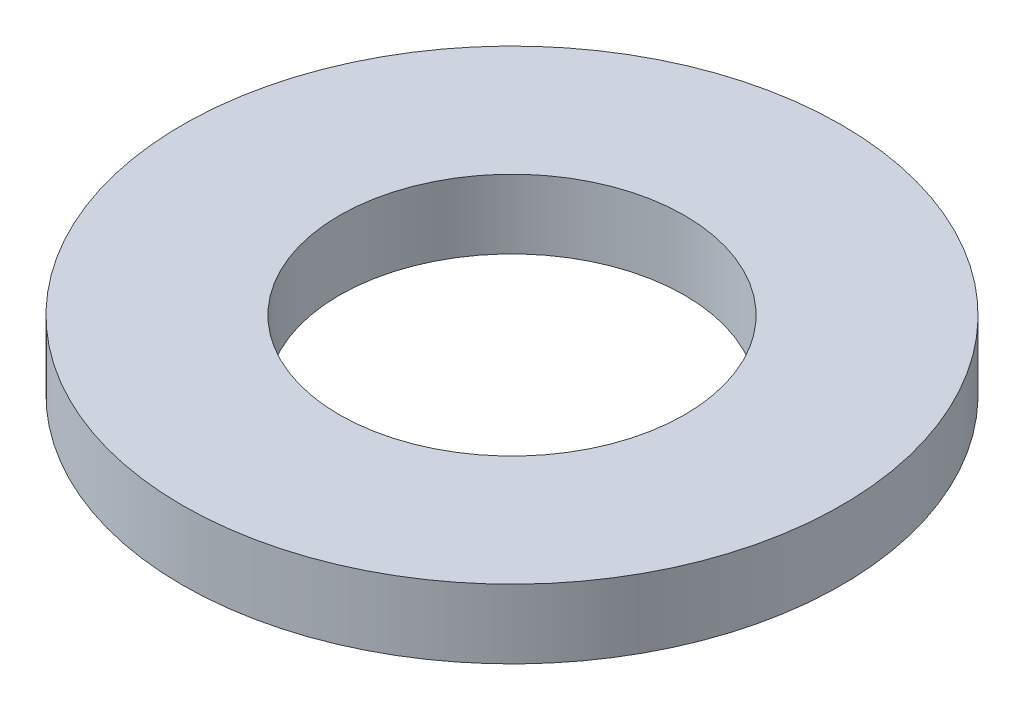
ISO-10303-21;
HEADER;
FILE_DESCRIPTION(('STEP AP214'),'2;1');
FILE_NAME('part.step','',(''),(''),'','','');
FILE_SCHEMA(('AUTOMOTIVE_DESIGN { 1 0 10303 214 1 1 1 1 }'));
ENDSEC;
DATA;
#1=APPLICATION_CONTEXT('core data for automotive mechanical design processes');
#2=APPLICATION_PROTOCOL_DEFINITION('international standard','automotive_design',2000,#1);
#3=PRODUCT_CONTEXT('',#1,'mechanical');
#4=PRODUCT('Part','Part','',(#3));
#5=PRODUCT_RELATED_PRODUCT_CATEGORY('part','',(#4));
#6=PRODUCT_DEFINITION_FORMATION('','',#4);
#7=PRODUCT_DEFINITION_CONTEXT('part definition',#1,'design');
#8=PRODUCT_DEFINITION('design','',#6,#7);
#9=PRODUCT_DEFINITION_SHAPE('','',#8);
#10=(LENGTH_UNIT() NAMED_UNIT(*) SI_UNIT(.MILLI.,.METRE.));
#11=(NAMED_UNIT(*) PLANE_ANGLE_UNIT() SI_UNIT($,.RADIAN.));
#12=(NAMED_UNIT(*) SI_UNIT($,.STERADIAN.) SOLID_ANGLE_UNIT());
#13=UNCERTAINTY_MEASURE_WITH_UNIT(LENGTH_MEASURE(1.E-05),#10,'distance_accuracy_value','');
#14=(GEOMETRIC_REPRESENTATION_CONTEXT(3) GLOBAL_UNCERTAINTY_ASSIGNED_CONTEXT((#13)) GLOBAL_UNIT_ASSIGNED_CONTEXT((#10,
#11,#12)) REPRESENTATION_CONTEXT('',''));
#15=CARTESIAN_POINT('',(0.,0.,0.));
#16=DIRECTION('',(0.,0.,1.));
#17=DIRECTION('',(1.,0.,0.));
#18=AXIS2_PLACEMENT_3D('',#15,#16,#17);
#19=CARTESIAN_POINT('',(0.,11.,0.));
#20=DIRECTION('',(0.,-1.,0.));
#21=DIRECTION('',(0.,0.,-1.));
#22=AXIS2_PLACEMENT_3D('',#19,#20,#21);
#23=CYLINDRICAL_SURFACE('',#22,52.5);
#24=CARTESIAN_POINT('',(0.,11.,0.));
#25=DIRECTION('',(0.,1.,0.));
#26=DIRECTION('',(0.,0.,1.));
#27=AXIS2_PLACEMENT_3D('',#24,#25,#26);
#28=CIRCLE('',#27,52.5);
#29=CARTESIAN_POINT('',(0.,11.,52.5));
#30=VERTEX_POINT('',#29);
#31=EDGE_CURVE('E10',#30,#30,#28,.T.);
#32=ORIENTED_EDGE('',*,*,#31,.F.);
#33=EDGE_LOOP('',(#32));
#34=FACE_BOUND('',#33,.T.);
#35=CARTESIAN_POINT('',(0.,0.,0.));
#36=DIRECTION('',(0.,1.,0.));
#37=DIRECTION('',(0.,0.,1.));
#38=AXIS2_PLACEMENT_3D('',#35,#36,#37);
#39=CIRCLE('',#38,52.5);
#40=CARTESIAN_POINT('',(0.,0.,52.5));
#41=VERTEX_POINT('',#40);
#42=EDGE_CURVE('E37',#41,#41,#39,.T.);
#43=ORIENTED_EDGE('',*,*,#42,.T.);
#44=EDGE_LOOP('',(#43));
#45=FACE_BOUND('',#44,.T.);
#46=ADVANCED_FACE('F40',(#34,#45),#23,.T.);
#47=CARTESIAN_POINT('',(0.,11.,0.));
#48=DIRECTION('',(0.,1.,0.));
#49=DIRECTION('',(0.,0.,1.));
#50=AXIS2_PLACEMENT_3D('',#47,#48,#49);
#51=PLANE('',#50);
#52=CARTESIAN_POINT('',(0.,11.,0.));
#53=DIRECTION('',(0.,1.,0.));
#54=DIRECTION('',(0.,0.,1.));
#55=AXIS2_PLACEMENT_3D('',#52,#53,#54);
#56=CIRCLE('',#55,27.5);
#57=CARTESIAN_POINT('',(0.,11.,27.5));
#58=VERTEX_POINT('',#57);
#59=EDGE_CURVE('E50',#58,#58,#56,.T.);
#60=ORIENTED_EDGE('',*,*,#59,.F.);
#61=EDGE_LOOP('',(#60));
#62=FACE_BOUND('',#61,.T.);
#63=ORIENTED_EDGE('',*,*,#31,.T.);
#64=EDGE_LOOP('',(#63));
#65=FACE_BOUND('',#64,.T.);
#66=ADVANCED_FACE('F59',(#62,#65),#51,.T.);
#67=CARTESIAN_POINT('',(0.,0.,0.));
#68=DIRECTION('',(0.,1.,0.));
#69=DIRECTION('',(0.,0.,1.));
#70=AXIS2_PLACEMENT_3D('',#67,#68,#69);
#71=PLANE('',#70);
#72=CARTESIAN_POINT('',(0.,0.,0.));
#73=DIRECTION('',(0.,1.,0.));
#74=DIRECTION('',(0.,0.,1.));
#75=AXIS2_PLACEMENT_3D('',#72,#73,#74);
#76=CIRCLE('',#75,27.5);
#77=CARTESIAN_POINT('',(0.,0.,27.5));
#78=VERTEX_POINT('',#77);
#79=EDGE_CURVE('E47',#78,#78,#76,.T.);
#80=ORIENTED_EDGE('',*,*,#79,.T.);
#81=EDGE_LOOP('',(#80));
#82=FACE_BOUND('',#81,.T.);
#83=ORIENTED_EDGE('',*,*,#42,.F.);
#84=EDGE_LOOP('',(#83));
#85=FACE_BOUND('',#84,.T.);
#86=ADVANCED_FACE('F58',(#82,#85),#71,.F.);
#87=CARTESIAN_POINT('',(0.,11.,0.));
#88=DIRECTION('',(0.,-1.,0.));
#89=DIRECTION('',(0.,0.,-1.));
#90=AXIS2_PLACEMENT_3D('',#87,#88,#89);
#91=CYLINDRICAL_SURFACE('',#90,27.5);
#92=ORIENTED_EDGE('',*,*,#59,.T.);
#93=EDGE_LOOP('',(#92));
#94=FACE_BOUND('',#93,.T.);
#95=ORIENTED_EDGE('',*,*,#79,.F.);
#96=EDGE_LOOP('',(#95));
#97=FACE_BOUND('',#96,.T.);
#98=ADVANCED_FACE('F54',(#94,#97),#91,.F.);
#99=CLOSED_SHELL('',(#46,#66,#86,#98));
#100=MANIFOLD_SOLID_BREP('B2',#99);
#101=ADVANCED_BREP_SHAPE_REPRESENTATION('',(#18,#100),#14);
#102=SHAPE_DEFINITION_REPRESENTATION(#9,#101);
ENDSEC;
END-ISO-10303-21;
